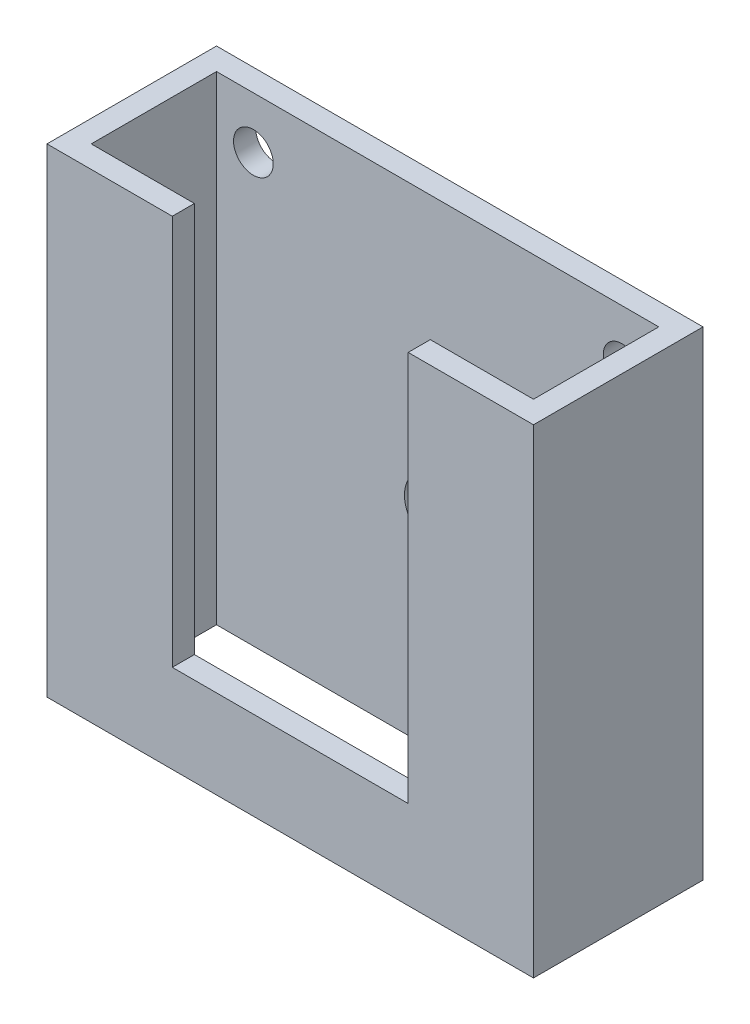
ISO-10303-21;
HEADER;
FILE_DESCRIPTION(('STEP AP214'),'2;1');
FILE_NAME('part.step','',(''),(''),'','','');
FILE_SCHEMA(('AUTOMOTIVE_DESIGN { 1 0 10303 214 1 1 1 1 }'));
ENDSEC;
DATA;
#1=APPLICATION_CONTEXT('core data for automotive mechanical design processes');
#2=APPLICATION_PROTOCOL_DEFINITION('international standard','automotive_design',2000,#1);
#3=PRODUCT_CONTEXT('',#1,'mechanical');
#4=PRODUCT('Part','Part','',(#3));
#5=PRODUCT_RELATED_PRODUCT_CATEGORY('part','',(#4));
#6=PRODUCT_DEFINITION_FORMATION('','',#4);
#7=PRODUCT_DEFINITION_CONTEXT('part definition',#1,'design');
#8=PRODUCT_DEFINITION('design','',#6,#7);
#9=PRODUCT_DEFINITION_SHAPE('','',#8);
#10=(LENGTH_UNIT() NAMED_UNIT(*) SI_UNIT(.MILLI.,.METRE.));
#11=(NAMED_UNIT(*) PLANE_ANGLE_UNIT() SI_UNIT($,.RADIAN.));
#12=(NAMED_UNIT(*) SI_UNIT($,.STERADIAN.) SOLID_ANGLE_UNIT());
#13=UNCERTAINTY_MEASURE_WITH_UNIT(LENGTH_MEASURE(1.E-05),#10,'distance_accuracy_value','');
#14=(GEOMETRIC_REPRESENTATION_CONTEXT(3) GLOBAL_UNCERTAINTY_ASSIGNED_CONTEXT((#13)) GLOBAL_UNIT_ASSIGNED_CONTEXT((#10,
#11,#12)) REPRESENTATION_CONTEXT('',''));
#15=CARTESIAN_POINT('',(0.,0.,0.));
#16=DIRECTION('',(0.,0.,1.));
#17=DIRECTION('',(1.,0.,0.));
#18=AXIS2_PLACEMENT_3D('',#15,#16,#17);
#19=CARTESIAN_POINT('',(-66.,0.,23.));
#20=DIRECTION('',(0.,1.,0.));
#21=DIRECTION('',(0.,0.,1.));
#22=AXIS2_PLACEMENT_3D('',#19,#20,#21);
#23=PLANE('',#22);
#24=DIRECTION('',(0.,0.,1.));
#25=VECTOR('',#24,1.);
#26=CARTESIAN_POINT('',(-49.,0.,-0.001000000000001));
#27=LINE('',#26,#25);
#28=CARTESIAN_POINT('',(-49.,0.,20.));
#29=VERTEX_POINT('',#28);
#30=CARTESIAN_POINT('',(-49.,0.,23.));
#31=VERTEX_POINT('',#30);
#32=EDGE_CURVE('E139',#29,#31,#27,.T.);
#33=ORIENTED_EDGE('',*,*,#32,.F.);
#34=DIRECTION('',(1.,0.,0.));
#35=VECTOR('',#34,1.);
#36=CARTESIAN_POINT('',(-63.,0.,20.));
#37=LINE('',#36,#35);
#38=CARTESIAN_POINT('',(-63.,0.,20.));
#39=VERTEX_POINT('',#38);
#40=EDGE_CURVE('E144',#39,#29,#37,.T.);
#41=ORIENTED_EDGE('',*,*,#40,.F.);
#42=DIRECTION('',(0.,0.,1.));
#43=VECTOR('',#42,1.);
#44=CARTESIAN_POINT('',(-63.,0.,20.));
#45=LINE('',#44,#43);
#46=CARTESIAN_POINT('',(-63.,0.,3.));
#47=VERTEX_POINT('',#46);
#48=EDGE_CURVE('E176',#47,#39,#45,.T.);
#49=ORIENTED_EDGE('',*,*,#48,.F.);
#50=DIRECTION('',(-1.,0.,0.));
#51=VECTOR('',#50,1.);
#52=CARTESIAN_POINT('',(-63.,0.,3.));
#53=LINE('',#52,#51);
#54=CARTESIAN_POINT('',(-3.,0.,3.));
#55=VERTEX_POINT('',#54);
#56=EDGE_CURVE('E173',#55,#47,#53,.T.);
#57=ORIENTED_EDGE('',*,*,#56,.F.);
#58=DIRECTION('',(0.,0.,-1.));
#59=VECTOR('',#58,1.);
#60=CARTESIAN_POINT('',(-3.,0.,20.));
#61=LINE('',#60,#59);
#62=CARTESIAN_POINT('',(-3.,0.,20.));
#63=VERTEX_POINT('',#62);
#64=EDGE_CURVE('E56',#63,#55,#61,.T.);
#65=ORIENTED_EDGE('',*,*,#64,.F.);
#66=CARTESIAN_POINT('',(-17.,0.,20.));
#67=VERTEX_POINT('',#66);
#68=EDGE_CURVE('E179',#67,#63,#37,.T.);
#69=ORIENTED_EDGE('',*,*,#68,.F.);
#70=DIRECTION('',(0.,0.,1.));
#71=VECTOR('',#70,1.);
#72=CARTESIAN_POINT('',(-17.,0.,-0.001000000000001));
#73=LINE('',#72,#71);
#74=CARTESIAN_POINT('',(-17.,0.,23.));
#75=VERTEX_POINT('',#74);
#76=EDGE_CURVE('E155',#67,#75,#73,.T.);
#77=ORIENTED_EDGE('',*,*,#76,.T.);
#78=DIRECTION('',(1.,0.,0.));
#79=VECTOR('',#78,1.);
#80=CARTESIAN_POINT('',(-66.,0.,23.));
#81=LINE('',#80,#79);
#82=CARTESIAN_POINT('',(0.,0.,23.));
#83=VERTEX_POINT('',#82);
#84=EDGE_CURVE('E202',#75,#83,#81,.T.);
#85=ORIENTED_EDGE('',*,*,#84,.T.);
#86=DIRECTION('',(0.,0.,1.));
#87=VECTOR('',#86,1.);
#88=CARTESIAN_POINT('',(0.,0.,23.));
#89=LINE('',#88,#87);
#90=CARTESIAN_POINT('',(0.,0.,0.));
#91=VERTEX_POINT('',#90);
#92=EDGE_CURVE('E183',#91,#83,#89,.T.);
#93=ORIENTED_EDGE('',*,*,#92,.F.);
#94=DIRECTION('',(1.,0.,0.));
#95=VECTOR('',#94,1.);
#96=CARTESIAN_POINT('',(-66.,0.,0.));
#97=LINE('',#96,#95);
#98=CARTESIAN_POINT('',(-66.,0.,0.));
#99=VERTEX_POINT('',#98);
#100=EDGE_CURVE('E11',#99,#91,#97,.T.);
#101=ORIENTED_EDGE('',*,*,#100,.F.);
#102=DIRECTION('',(0.,0.,1.));
#103=VECTOR('',#102,1.);
#104=CARTESIAN_POINT('',(-66.,0.,23.));
#105=LINE('',#104,#103);
#106=CARTESIAN_POINT('',(-66.,0.,23.));
#107=VERTEX_POINT('',#106);
#108=EDGE_CURVE('E189',#99,#107,#105,.T.);
#109=ORIENTED_EDGE('',*,*,#108,.T.);
#110=EDGE_CURVE('E35',#107,#31,#81,.T.);
#111=ORIENTED_EDGE('',*,*,#110,.T.);
#112=EDGE_LOOP('',(#33,#41,#49,#57,#65,#69,#77,#85,#93,#101,#109,#111));
#113=FACE_BOUND('',#112,.T.);
#114=ADVANCED_FACE('F32',(#113),#23,.T.);
#115=CARTESIAN_POINT('',(-66.,0.,0.));
#116=DIRECTION('',(0.,0.,-1.));
#117=DIRECTION('',(-1.,0.,0.));
#118=AXIS2_PLACEMENT_3D('',#115,#116,#117);
#119=PLANE('',#118);
#120=CARTESIAN_POINT('',(-33.,-37.,0.));
#121=DIRECTION('',(0.,0.,-1.));
#122=DIRECTION('',(-1.,0.,0.));
#123=AXIS2_PLACEMENT_3D('',#120,#121,#122);
#124=CIRCLE('',#123,4.50000000000001);
#125=CARTESIAN_POINT('',(-37.5,-37.,0.));
#126=VERTEX_POINT('',#125);
#127=EDGE_CURVE('E356',#126,#126,#124,.T.);
#128=ORIENTED_EDGE('',*,*,#127,.F.);
#129=EDGE_LOOP('',(#128));
#130=FACE_BOUND('',#129,.T.);
#131=CARTESIAN_POINT('',(-8.,-7.00000000000001,0.));
#132=DIRECTION('',(0.,0.,-1.));
#133=DIRECTION('',(-1.,0.,0.));
#134=AXIS2_PLACEMENT_3D('',#131,#132,#133);
#135=CIRCLE('',#134,2.5305862175137);
#136=CARTESIAN_POINT('',(-10.5305862175137,-7.00000000000001,0.));
#137=VERTEX_POINT('',#136);
#138=EDGE_CURVE('E360',#137,#137,#135,.T.);
#139=ORIENTED_EDGE('',*,*,#138,.F.);
#140=EDGE_LOOP('',(#139));
#141=FACE_BOUND('',#140,.T.);
#142=CARTESIAN_POINT('',(-58.,-7.,0.));
#143=DIRECTION('',(0.,0.,-1.));
#144=DIRECTION('',(-1.,0.,0.));
#145=AXIS2_PLACEMENT_3D('',#142,#143,#144);
#146=CIRCLE('',#145,2.69284221962874);
#147=CARTESIAN_POINT('',(-60.6928422196287,-7.,0.));
#148=VERTEX_POINT('',#147);
#149=EDGE_CURVE('E366',#148,#148,#146,.T.);
#150=ORIENTED_EDGE('',*,*,#149,.F.);
#151=EDGE_LOOP('',(#150));
#152=FACE_BOUND('',#151,.T.);
#153=DIRECTION('',(0.,1.,0.));
#154=VECTOR('',#153,1.);
#155=CARTESIAN_POINT('',(0.,0.,0.));
#156=LINE('',#155,#154);
#157=CARTESIAN_POINT('',(0.,-65.,0.));
#158=VERTEX_POINT('',#157);
#159=EDGE_CURVE('E193',#158,#91,#156,.T.);
#160=ORIENTED_EDGE('',*,*,#159,.F.);
#161=DIRECTION('',(1.,0.,0.));
#162=VECTOR('',#161,1.);
#163=CARTESIAN_POINT('',(-66.,-65.,0.));
#164=LINE('',#163,#162);
#165=CARTESIAN_POINT('',(-66.,-65.,0.));
#166=VERTEX_POINT('',#165);
#167=EDGE_CURVE('E40',#166,#158,#164,.T.);
#168=ORIENTED_EDGE('',*,*,#167,.F.);
#169=DIRECTION('',(0.,1.,0.));
#170=VECTOR('',#169,1.);
#171=CARTESIAN_POINT('',(-66.,0.,0.));
#172=LINE('',#171,#170);
#173=EDGE_CURVE('E199',#166,#99,#172,.T.);
#174=ORIENTED_EDGE('',*,*,#173,.T.);
#175=ORIENTED_EDGE('',*,*,#100,.T.);
#176=EDGE_LOOP('',(#160,#168,#174,#175));
#177=FACE_BOUND('',#176,.T.);
#178=ADVANCED_FACE('F228',(#130,#141,#152,#177),#119,.T.);
#179=CARTESIAN_POINT('',(-66.,-65.,0.));
#180=DIRECTION('',(0.,-1.,0.));
#181=DIRECTION('',(0.,0.,-1.));
#182=AXIS2_PLACEMENT_3D('',#179,#180,#181);
#183=PLANE('',#182);
#184=DIRECTION('',(0.,0.,-1.));
#185=VECTOR('',#184,1.);
#186=CARTESIAN_POINT('',(-3.,-65.,20.));
#187=LINE('',#186,#185);
#188=CARTESIAN_POINT('',(-3.,-65.,20.));
#189=VERTEX_POINT('',#188);
#190=CARTESIAN_POINT('',(-3.,-65.,3.));
#191=VERTEX_POINT('',#190);
#192=EDGE_CURVE('E159',#189,#191,#187,.T.);
#193=ORIENTED_EDGE('',*,*,#192,.T.);
#194=DIRECTION('',(-1.,0.,0.));
#195=VECTOR('',#194,1.);
#196=CARTESIAN_POINT('',(-63.,-65.,3.));
#197=LINE('',#196,#195);
#198=CARTESIAN_POINT('',(-63.,-65.,3.));
#199=VERTEX_POINT('',#198);
#200=EDGE_CURVE('E162',#191,#199,#197,.T.);
#201=ORIENTED_EDGE('',*,*,#200,.T.);
#202=DIRECTION('',(0.,0.,1.));
#203=VECTOR('',#202,1.);
#204=CARTESIAN_POINT('',(-63.,-65.,20.));
#205=LINE('',#204,#203);
#206=CARTESIAN_POINT('',(-63.,-65.,20.));
#207=VERTEX_POINT('',#206);
#208=EDGE_CURVE('E165',#199,#207,#205,.T.);
#209=ORIENTED_EDGE('',*,*,#208,.T.);
#210=DIRECTION('',(1.,0.,0.));
#211=VECTOR('',#210,1.);
#212=CARTESIAN_POINT('',(-63.,-65.,20.));
#213=LINE('',#212,#211);
#214=EDGE_CURVE('E168',#207,#189,#213,.T.);
#215=ORIENTED_EDGE('',*,*,#214,.T.);
#216=EDGE_LOOP('',(#193,#201,#209,#215));
#217=FACE_BOUND('',#216,.T.);
#218=DIRECTION('',(0.,0.,-1.));
#219=VECTOR('',#218,1.);
#220=CARTESIAN_POINT('',(0.,-65.,0.));
#221=LINE('',#220,#219);
#222=CARTESIAN_POINT('',(0.,-65.,23.));
#223=VERTEX_POINT('',#222);
#224=EDGE_CURVE('E208',#223,#158,#221,.T.);
#225=ORIENTED_EDGE('',*,*,#224,.F.);
#226=DIRECTION('',(1.,0.,0.));
#227=VECTOR('',#226,1.);
#228=CARTESIAN_POINT('',(-66.,-65.,23.));
#229=LINE('',#228,#227);
#230=CARTESIAN_POINT('',(-66.,-65.,23.));
#231=VERTEX_POINT('',#230);
#232=EDGE_CURVE('E213',#231,#223,#229,.T.);
#233=ORIENTED_EDGE('',*,*,#232,.F.);
#234=DIRECTION('',(0.,0.,-1.));
#235=VECTOR('',#234,1.);
#236=CARTESIAN_POINT('',(-66.,-65.,0.));
#237=LINE('',#236,#235);
#238=EDGE_CURVE('E196',#231,#166,#237,.T.);
#239=ORIENTED_EDGE('',*,*,#238,.T.);
#240=ORIENTED_EDGE('',*,*,#167,.T.);
#241=EDGE_LOOP('',(#225,#233,#239,#240));
#242=FACE_BOUND('',#241,.T.);
#243=ADVANCED_FACE('F246',(#217,#242),#183,.T.);
#244=CARTESIAN_POINT('',(-66.,-65.,23.));
#245=DIRECTION('',(0.,0.,1.));
#246=DIRECTION('',(1.,0.,0.));
#247=AXIS2_PLACEMENT_3D('',#244,#245,#246);
#248=PLANE('',#247);
#249=DIRECTION('',(0.,-1.,0.));
#250=VECTOR('',#249,1.);
#251=CARTESIAN_POINT('',(-49.,0.,23.));
#252=LINE('',#251,#250);
#253=CARTESIAN_POINT('',(-49.,-53.,23.));
#254=VERTEX_POINT('',#253);
#255=EDGE_CURVE('E128',#31,#254,#252,.T.);
#256=ORIENTED_EDGE('',*,*,#255,.F.);
#257=ORIENTED_EDGE('',*,*,#110,.F.);
#258=DIRECTION('',(0.,-1.,0.));
#259=VECTOR('',#258,1.);
#260=CARTESIAN_POINT('',(-66.,-65.,23.));
#261=LINE('',#260,#259);
#262=EDGE_CURVE('E192',#107,#231,#261,.T.);
#263=ORIENTED_EDGE('',*,*,#262,.T.);
#264=ORIENTED_EDGE('',*,*,#232,.T.);
#265=DIRECTION('',(0.,-1.,0.));
#266=VECTOR('',#265,1.);
#267=CARTESIAN_POINT('',(0.,-65.,23.));
#268=LINE('',#267,#266);
#269=EDGE_CURVE('E205',#83,#223,#268,.T.);
#270=ORIENTED_EDGE('',*,*,#269,.F.);
#271=ORIENTED_EDGE('',*,*,#84,.F.);
#272=DIRECTION('',(0.,1.,0.));
#273=VECTOR('',#272,1.);
#274=CARTESIAN_POINT('',(-17.,0.,23.));
#275=LINE('',#274,#273);
#276=CARTESIAN_POINT('',(-17.,-53.,23.));
#277=VERTEX_POINT('',#276);
#278=EDGE_CURVE('E133',#277,#75,#275,.T.);
#279=ORIENTED_EDGE('',*,*,#278,.F.);
#280=DIRECTION('',(1.,0.,0.));
#281=VECTOR('',#280,1.);
#282=CARTESIAN_POINT('',(-49.,-53.,23.));
#283=LINE('',#282,#281);
#284=EDGE_CURVE('E146',#254,#277,#283,.T.);
#285=ORIENTED_EDGE('',*,*,#284,.F.);
#286=EDGE_LOOP('',(#256,#257,#263,#264,#270,#271,#279,#285));
#287=FACE_BOUND('',#286,.T.);
#288=ADVANCED_FACE('F223',(#287),#248,.T.);
#289=CARTESIAN_POINT('',(-66.,0.,0.));
#290=DIRECTION('',(-1.,0.,0.));
#291=DIRECTION('',(0.,0.,1.));
#292=AXIS2_PLACEMENT_3D('',#289,#290,#291);
#293=PLANE('',#292);
#294=ORIENTED_EDGE('',*,*,#108,.F.);
#295=ORIENTED_EDGE('',*,*,#173,.F.);
#296=ORIENTED_EDGE('',*,*,#238,.F.);
#297=ORIENTED_EDGE('',*,*,#262,.F.);
#298=EDGE_LOOP('',(#294,#295,#296,#297));
#299=FACE_BOUND('',#298,.T.);
#300=ADVANCED_FACE('F233',(#299),#293,.T.);
#301=CARTESIAN_POINT('',(0.,0.,0.));
#302=DIRECTION('',(-1.,0.,0.));
#303=DIRECTION('',(0.,0.,1.));
#304=AXIS2_PLACEMENT_3D('',#301,#302,#303);
#305=PLANE('',#304);
#306=ORIENTED_EDGE('',*,*,#92,.T.);
#307=ORIENTED_EDGE('',*,*,#269,.T.);
#308=ORIENTED_EDGE('',*,*,#224,.T.);
#309=ORIENTED_EDGE('',*,*,#159,.T.);
#310=EDGE_LOOP('',(#306,#307,#308,#309));
#311=FACE_BOUND('',#310,.T.);
#312=ADVANCED_FACE('F225',(#311),#305,.F.);
#313=CARTESIAN_POINT('',(-3.,-65.,20.));
#314=DIRECTION('',(1.,0.,0.));
#315=DIRECTION('',(0.,0.,-1.));
#316=AXIS2_PLACEMENT_3D('',#313,#314,#315);
#317=PLANE('',#316);
#318=ORIENTED_EDGE('',*,*,#64,.T.);
#319=DIRECTION('',(0.,1.,0.));
#320=VECTOR('',#319,1.);
#321=CARTESIAN_POINT('',(-3.,-65.,3.));
#322=LINE('',#321,#320);
#323=EDGE_CURVE('E171',#191,#55,#322,.T.);
#324=ORIENTED_EDGE('',*,*,#323,.F.);
#325=ORIENTED_EDGE('',*,*,#192,.F.);
#326=DIRECTION('',(0.,1.,0.));
#327=VECTOR('',#326,1.);
#328=CARTESIAN_POINT('',(-3.,-65.,20.));
#329=LINE('',#328,#327);
#330=EDGE_CURVE('E181',#189,#63,#329,.T.);
#331=ORIENTED_EDGE('',*,*,#330,.T.);
#332=EDGE_LOOP('',(#318,#324,#325,#331));
#333=FACE_BOUND('',#332,.T.);
#334=ADVANCED_FACE('F243',(#333),#317,.F.);
#335=CARTESIAN_POINT('',(-63.,-65.,20.));
#336=DIRECTION('',(0.,0.,1.));
#337=DIRECTION('',(1.,0.,0.));
#338=AXIS2_PLACEMENT_3D('',#335,#336,#337);
#339=PLANE('',#338);
#340=ORIENTED_EDGE('',*,*,#40,.T.);
#341=DIRECTION('',(0.,1.,0.));
#342=VECTOR('',#341,1.);
#343=CARTESIAN_POINT('',(-49.,0.,20.));
#344=LINE('',#343,#342);
#345=CARTESIAN_POINT('',(-49.,-53.,20.));
#346=VERTEX_POINT('',#345);
#347=EDGE_CURVE('E125',#346,#29,#344,.T.);
#348=ORIENTED_EDGE('',*,*,#347,.F.);
#349=DIRECTION('',(-1.,0.,0.));
#350=VECTOR('',#349,1.);
#351=CARTESIAN_POINT('',(-49.,-53.,20.));
#352=LINE('',#351,#350);
#353=CARTESIAN_POINT('',(-17.,-53.,20.));
#354=VERTEX_POINT('',#353);
#355=EDGE_CURVE('E136',#354,#346,#352,.T.);
#356=ORIENTED_EDGE('',*,*,#355,.F.);
#357=DIRECTION('',(0.,-1.,0.));
#358=VECTOR('',#357,1.);
#359=CARTESIAN_POINT('',(-17.,0.,20.));
#360=LINE('',#359,#358);
#361=EDGE_CURVE('E48',#67,#354,#360,.T.);
#362=ORIENTED_EDGE('',*,*,#361,.F.);
#363=ORIENTED_EDGE('',*,*,#68,.T.);
#364=ORIENTED_EDGE('',*,*,#330,.F.);
#365=ORIENTED_EDGE('',*,*,#214,.F.);
#366=DIRECTION('',(0.,1.,0.));
#367=VECTOR('',#366,1.);
#368=CARTESIAN_POINT('',(-63.,-65.,20.));
#369=LINE('',#368,#367);
#370=EDGE_CURVE('E184',#207,#39,#369,.T.);
#371=ORIENTED_EDGE('',*,*,#370,.T.);
#372=EDGE_LOOP('',(#340,#348,#356,#362,#363,#364,#365,#371));
#373=FACE_BOUND('',#372,.T.);
#374=ADVANCED_FACE('F142',(#373),#339,.F.);
#375=CARTESIAN_POINT('',(-63.,-65.,20.));
#376=DIRECTION('',(-1.,0.,0.));
#377=DIRECTION('',(0.,0.,1.));
#378=AXIS2_PLACEMENT_3D('',#375,#376,#377);
#379=PLANE('',#378);
#380=ORIENTED_EDGE('',*,*,#48,.T.);
#381=ORIENTED_EDGE('',*,*,#370,.F.);
#382=ORIENTED_EDGE('',*,*,#208,.F.);
#383=DIRECTION('',(0.,1.,0.));
#384=VECTOR('',#383,1.);
#385=CARTESIAN_POINT('',(-63.,-65.,3.));
#386=LINE('',#385,#384);
#387=EDGE_CURVE('E186',#199,#47,#386,.T.);
#388=ORIENTED_EDGE('',*,*,#387,.T.);
#389=EDGE_LOOP('',(#380,#381,#382,#388));
#390=FACE_BOUND('',#389,.T.);
#391=ADVANCED_FACE('F249',(#390),#379,.F.);
#392=CARTESIAN_POINT('',(-63.,-65.,3.));
#393=DIRECTION('',(0.,0.,-1.));
#394=DIRECTION('',(-1.,0.,0.));
#395=AXIS2_PLACEMENT_3D('',#392,#393,#394);
#396=PLANE('',#395);
#397=CARTESIAN_POINT('',(-33.,-37.,3.));
#398=DIRECTION('',(0.,0.,-1.));
#399=DIRECTION('',(-1.,0.,0.));
#400=AXIS2_PLACEMENT_3D('',#397,#398,#399);
#401=CIRCLE('',#400,4.50000000000001);
#402=CARTESIAN_POINT('',(-37.5,-37.,3.));
#403=VERTEX_POINT('',#402);
#404=EDGE_CURVE('E148',#403,#403,#401,.F.);
#405=ORIENTED_EDGE('',*,*,#404,.F.);
#406=EDGE_LOOP('',(#405));
#407=FACE_BOUND('',#406,.T.);
#408=CARTESIAN_POINT('',(-8.,-7.00000000000001,3.));
#409=DIRECTION('',(0.,0.,-1.));
#410=DIRECTION('',(-1.,0.,0.));
#411=AXIS2_PLACEMENT_3D('',#408,#409,#410);
#412=CIRCLE('',#411,2.5305862175137);
#413=CARTESIAN_POINT('',(-10.5305862175137,-7.00000000000001,3.));
#414=VERTEX_POINT('',#413);
#415=EDGE_CURVE('E363',#414,#414,#412,.F.);
#416=ORIENTED_EDGE('',*,*,#415,.F.);
#417=EDGE_LOOP('',(#416));
#418=FACE_BOUND('',#417,.T.);
#419=CARTESIAN_POINT('',(-58.,-7.,3.));
#420=DIRECTION('',(0.,0.,-1.));
#421=DIRECTION('',(-1.,0.,0.));
#422=AXIS2_PLACEMENT_3D('',#419,#420,#421);
#423=CIRCLE('',#422,2.69284221962874);
#424=CARTESIAN_POINT('',(-60.6928422196287,-7.,3.));
#425=VERTEX_POINT('',#424);
#426=EDGE_CURVE('E369',#425,#425,#423,.F.);
#427=ORIENTED_EDGE('',*,*,#426,.F.);
#428=EDGE_LOOP('',(#427));
#429=FACE_BOUND('',#428,.T.);
#430=ORIENTED_EDGE('',*,*,#56,.T.);
#431=ORIENTED_EDGE('',*,*,#387,.F.);
#432=ORIENTED_EDGE('',*,*,#200,.F.);
#433=ORIENTED_EDGE('',*,*,#323,.T.);
#434=EDGE_LOOP('',(#430,#431,#432,#433));
#435=FACE_BOUND('',#434,.T.);
#436=ADVANCED_FACE('F240',(#407,#418,#429,#435),#396,.F.);
#437=CARTESIAN_POINT('',(-49.,0.,-0.001000000000001));
#438=DIRECTION('',(-1.,0.,0.));
#439=DIRECTION('',(0.,-1.,0.));
#440=AXIS2_PLACEMENT_3D('',#437,#438,#439);
#441=PLANE('',#440);
#442=ORIENTED_EDGE('',*,*,#347,.T.);
#443=ORIENTED_EDGE('',*,*,#32,.T.);
#444=ORIENTED_EDGE('',*,*,#255,.T.);
#445=DIRECTION('',(0.,0.,1.));
#446=VECTOR('',#445,1.);
#447=CARTESIAN_POINT('',(-49.,-53.,-0.001000000000001));
#448=LINE('',#447,#446);
#449=EDGE_CURVE('E121',#346,#254,#448,.T.);
#450=ORIENTED_EDGE('',*,*,#449,.F.);
#451=EDGE_LOOP('',(#442,#443,#444,#450));
#452=FACE_BOUND('',#451,.T.);
#453=ADVANCED_FACE('F123',(#452),#441,.F.);
#454=CARTESIAN_POINT('',(-17.,0.,-0.001000000000001));
#455=DIRECTION('',(1.,0.,0.));
#456=DIRECTION('',(0.,1.,0.));
#457=AXIS2_PLACEMENT_3D('',#454,#455,#456);
#458=PLANE('',#457);
#459=ORIENTED_EDGE('',*,*,#361,.T.);
#460=DIRECTION('',(0.,0.,1.));
#461=VECTOR('',#460,1.);
#462=CARTESIAN_POINT('',(-17.,-53.,-0.001000000000001));
#463=LINE('',#462,#461);
#464=EDGE_CURVE('E132',#354,#277,#463,.T.);
#465=ORIENTED_EDGE('',*,*,#464,.T.);
#466=ORIENTED_EDGE('',*,*,#278,.T.);
#467=ORIENTED_EDGE('',*,*,#76,.F.);
#468=EDGE_LOOP('',(#459,#465,#466,#467));
#469=FACE_BOUND('',#468,.T.);
#470=ADVANCED_FACE('F235',(#469),#458,.F.);
#471=CARTESIAN_POINT('',(-49.,-53.,-0.001000000000001));
#472=DIRECTION('',(0.,-1.,0.));
#473=DIRECTION('',(0.,0.,-1.));
#474=AXIS2_PLACEMENT_3D('',#471,#472,#473);
#475=PLANE('',#474);
#476=ORIENTED_EDGE('',*,*,#355,.T.);
#477=ORIENTED_EDGE('',*,*,#449,.T.);
#478=ORIENTED_EDGE('',*,*,#284,.T.);
#479=ORIENTED_EDGE('',*,*,#464,.F.);
#480=EDGE_LOOP('',(#476,#477,#478,#479));
#481=FACE_BOUND('',#480,.T.);
#482=ADVANCED_FACE('F137',(#481),#475,.F.);
#483=CARTESIAN_POINT('',(-58.,-7.,23.001));
#484=DIRECTION('',(0.,0.,-1.));
#485=DIRECTION('',(-1.,0.,0.));
#486=AXIS2_PLACEMENT_3D('',#483,#484,#485);
#487=CYLINDRICAL_SURFACE('',#486,2.69284221962874);
#488=ORIENTED_EDGE('',*,*,#149,.T.);
#489=EDGE_LOOP('',(#488));
#490=FACE_BOUND('',#489,.T.);
#491=ORIENTED_EDGE('',*,*,#426,.T.);
#492=EDGE_LOOP('',(#491));
#493=FACE_BOUND('',#492,.T.);
#494=ADVANCED_FACE('F320',(#490,#493),#487,.F.);
#495=CARTESIAN_POINT('',(-8.,-7.00000000000001,23.001));
#496=DIRECTION('',(0.,0.,-1.));
#497=DIRECTION('',(-1.,0.,0.));
#498=AXIS2_PLACEMENT_3D('',#495,#496,#497);
#499=CYLINDRICAL_SURFACE('',#498,2.5305862175137);
#500=ORIENTED_EDGE('',*,*,#138,.T.);
#501=EDGE_LOOP('',(#500));
#502=FACE_BOUND('',#501,.T.);
#503=ORIENTED_EDGE('',*,*,#415,.T.);
#504=EDGE_LOOP('',(#503));
#505=FACE_BOUND('',#504,.T.);
#506=ADVANCED_FACE('F330',(#502,#505),#499,.F.);
#507=CARTESIAN_POINT('',(-33.,-37.,23.001));
#508=DIRECTION('',(0.,0.,-1.));
#509=DIRECTION('',(-1.,0.,0.));
#510=AXIS2_PLACEMENT_3D('',#507,#508,#509);
#511=CYLINDRICAL_SURFACE('',#510,4.50000000000001);
#512=ORIENTED_EDGE('',*,*,#127,.T.);
#513=EDGE_LOOP('',(#512));
#514=FACE_BOUND('',#513,.T.);
#515=ORIENTED_EDGE('',*,*,#404,.T.);
#516=EDGE_LOOP('',(#515));
#517=FACE_BOUND('',#516,.T.);
#518=ADVANCED_FACE('F337',(#514,#517),#511,.F.);
#519=CLOSED_SHELL('',(#114,#178,#243,#288,#300,#312,#334,#374,#391,#436,#453,#470,#482,#494,
#506,#518));
#520=MANIFOLD_SOLID_BREP('B2',#519);
#521=ADVANCED_BREP_SHAPE_REPRESENTATION('',(#18,#520),#14);
#522=SHAPE_DEFINITION_REPRESENTATION(#9,#521);
ENDSEC;
END-ISO-10303-21;
